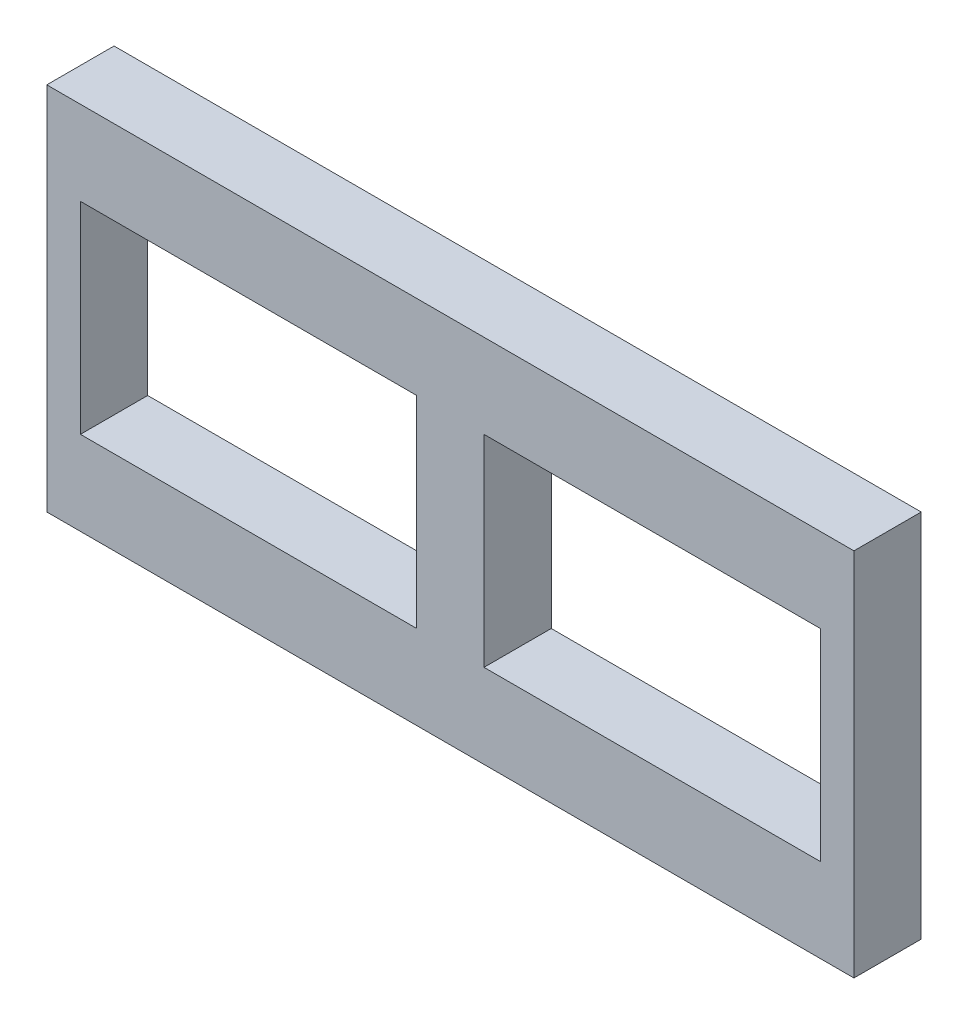
ISO-10303-21;
HEADER;
FILE_DESCRIPTION(('STEP AP214'),'2;1');
FILE_NAME('part.step','',(''),(''),'','','');
FILE_SCHEMA(('AUTOMOTIVE_DESIGN { 1 0 10303 214 1 1 1 1 }'));
ENDSEC;
DATA;
#1=APPLICATION_CONTEXT('core data for automotive mechanical design processes');
#2=APPLICATION_PROTOCOL_DEFINITION('international standard','automotive_design',2000,#1);
#3=PRODUCT_CONTEXT('',#1,'mechanical');
#4=PRODUCT('Part','Part','',(#3));
#5=PRODUCT_RELATED_PRODUCT_CATEGORY('part','',(#4));
#6=PRODUCT_DEFINITION_FORMATION('','',#4);
#7=PRODUCT_DEFINITION_CONTEXT('part definition',#1,'design');
#8=PRODUCT_DEFINITION('design','',#6,#7);
#9=PRODUCT_DEFINITION_SHAPE('','',#8);
#10=(LENGTH_UNIT() NAMED_UNIT(*) SI_UNIT(.MILLI.,.METRE.));
#11=(NAMED_UNIT(*) PLANE_ANGLE_UNIT() SI_UNIT($,.RADIAN.));
#12=(NAMED_UNIT(*) SI_UNIT($,.STERADIAN.) SOLID_ANGLE_UNIT());
#13=UNCERTAINTY_MEASURE_WITH_UNIT(LENGTH_MEASURE(1.E-05),#10,'distance_accuracy_value','');
#14=(GEOMETRIC_REPRESENTATION_CONTEXT(3) GLOBAL_UNCERTAINTY_ASSIGNED_CONTEXT((#13)) GLOBAL_UNIT_ASSIGNED_CONTEXT((#10,
#11,#12)) REPRESENTATION_CONTEXT('',''));
#15=CARTESIAN_POINT('',(0.,0.,0.));
#16=DIRECTION('',(0.,0.,1.));
#17=DIRECTION('',(1.,0.,0.));
#18=AXIS2_PLACEMENT_3D('',#15,#16,#17);
#19=CARTESIAN_POINT('',(-60.,27.5,10.));
#20=DIRECTION('',(1.,0.,0.));
#21=DIRECTION('',(0.,1.,0.));
#22=AXIS2_PLACEMENT_3D('',#19,#20,#21);
#23=PLANE('',#22);
#24=DIRECTION('',(0.,-1.,0.));
#25=VECTOR('',#24,1.);
#26=CARTESIAN_POINT('',(-60.,27.5,0.));
#27=LINE('',#26,#25);
#28=CARTESIAN_POINT('',(-60.,27.5,0.));
#29=VERTEX_POINT('',#28);
#30=CARTESIAN_POINT('',(-60.,-27.5,0.));
#31=VERTEX_POINT('',#30);
#32=EDGE_CURVE('E176',#29,#31,#27,.T.);
#33=ORIENTED_EDGE('',*,*,#32,.T.);
#34=DIRECTION('',(0.,0.,-1.));
#35=VECTOR('',#34,1.);
#36=CARTESIAN_POINT('',(-60.,-27.5,10.));
#37=LINE('',#36,#35);
#38=CARTESIAN_POINT('',(-60.,-27.5,10.));
#39=VERTEX_POINT('',#38);
#40=EDGE_CURVE('E11',#39,#31,#37,.T.);
#41=ORIENTED_EDGE('',*,*,#40,.F.);
#42=DIRECTION('',(0.,-1.,0.));
#43=VECTOR('',#42,1.);
#44=CARTESIAN_POINT('',(-60.,27.5,10.));
#45=LINE('',#44,#43);
#46=CARTESIAN_POINT('',(-60.,27.5,10.));
#47=VERTEX_POINT('',#46);
#48=EDGE_CURVE('E223',#47,#39,#45,.T.);
#49=ORIENTED_EDGE('',*,*,#48,.F.);
#50=DIRECTION('',(0.,0.,-1.));
#51=VECTOR('',#50,1.);
#52=CARTESIAN_POINT('',(-60.,27.5,10.));
#53=LINE('',#52,#51);
#54=EDGE_CURVE('E237',#47,#29,#53,.T.);
#55=ORIENTED_EDGE('',*,*,#54,.T.);
#56=EDGE_LOOP('',(#33,#41,#49,#55));
#57=FACE_BOUND('',#56,.T.);
#58=ADVANCED_FACE('F39',(#57),#23,.F.);
#59=CARTESIAN_POINT('',(-60.,-27.5,10.));
#60=DIRECTION('',(0.,1.,0.));
#61=DIRECTION('',(0.,0.,1.));
#62=AXIS2_PLACEMENT_3D('',#59,#60,#61);
#63=PLANE('',#62);
#64=DIRECTION('',(1.,0.,0.));
#65=VECTOR('',#64,1.);
#66=CARTESIAN_POINT('',(-60.,-27.5,0.));
#67=LINE('',#66,#65);
#68=CARTESIAN_POINT('',(60.,-27.5,0.));
#69=VERTEX_POINT('',#68);
#70=EDGE_CURVE('E241',#31,#69,#67,.T.);
#71=ORIENTED_EDGE('',*,*,#70,.T.);
#72=DIRECTION('',(0.,0.,-1.));
#73=VECTOR('',#72,1.);
#74=CARTESIAN_POINT('',(60.,-27.5,10.));
#75=LINE('',#74,#73);
#76=CARTESIAN_POINT('',(60.,-27.5,10.));
#77=VERTEX_POINT('',#76);
#78=EDGE_CURVE('E47',#77,#69,#75,.T.);
#79=ORIENTED_EDGE('',*,*,#78,.F.);
#80=DIRECTION('',(1.,0.,0.));
#81=VECTOR('',#80,1.);
#82=CARTESIAN_POINT('',(-60.,-27.5,10.));
#83=LINE('',#82,#81);
#84=EDGE_CURVE('E227',#39,#77,#83,.T.);
#85=ORIENTED_EDGE('',*,*,#84,.F.);
#86=ORIENTED_EDGE('',*,*,#40,.T.);
#87=EDGE_LOOP('',(#71,#79,#85,#86));
#88=FACE_BOUND('',#87,.T.);
#89=ADVANCED_FACE('F276',(#88),#63,.F.);
#90=CARTESIAN_POINT('',(60.,27.5,10.));
#91=DIRECTION('',(-1.,0.,0.));
#92=DIRECTION('',(0.,-1.,0.));
#93=AXIS2_PLACEMENT_3D('',#90,#91,#92);
#94=PLANE('',#93);
#95=DIRECTION('',(0.,1.,0.));
#96=VECTOR('',#95,1.);
#97=CARTESIAN_POINT('',(60.,27.5,0.));
#98=LINE('',#97,#96);
#99=CARTESIAN_POINT('',(60.,27.5,0.));
#100=VERTEX_POINT('',#99);
#101=EDGE_CURVE('E244',#69,#100,#98,.T.);
#102=ORIENTED_EDGE('',*,*,#101,.T.);
#103=DIRECTION('',(0.,0.,-1.));
#104=VECTOR('',#103,1.);
#105=CARTESIAN_POINT('',(60.,27.5,10.));
#106=LINE('',#105,#104);
#107=CARTESIAN_POINT('',(60.,27.5,10.));
#108=VERTEX_POINT('',#107);
#109=EDGE_CURVE('E252',#108,#100,#106,.T.);
#110=ORIENTED_EDGE('',*,*,#109,.F.);
#111=DIRECTION('',(0.,1.,0.));
#112=VECTOR('',#111,1.);
#113=CARTESIAN_POINT('',(60.,27.5,10.));
#114=LINE('',#113,#112);
#115=EDGE_CURVE('E231',#77,#108,#114,.T.);
#116=ORIENTED_EDGE('',*,*,#115,.F.);
#117=ORIENTED_EDGE('',*,*,#78,.T.);
#118=EDGE_LOOP('',(#102,#110,#116,#117));
#119=FACE_BOUND('',#118,.T.);
#120=ADVANCED_FACE('F261',(#119),#94,.F.);
#121=CARTESIAN_POINT('',(-60.,27.5,10.));
#122=DIRECTION('',(0.,-1.,0.));
#123=DIRECTION('',(0.,0.,-1.));
#124=AXIS2_PLACEMENT_3D('',#121,#122,#123);
#125=PLANE('',#124);
#126=DIRECTION('',(-1.,0.,0.));
#127=VECTOR('',#126,1.);
#128=CARTESIAN_POINT('',(-60.,27.5,0.));
#129=LINE('',#128,#127);
#130=EDGE_CURVE('E228',#100,#29,#129,.T.);
#131=ORIENTED_EDGE('',*,*,#130,.T.);
#132=ORIENTED_EDGE('',*,*,#54,.F.);
#133=DIRECTION('',(-1.,0.,0.));
#134=VECTOR('',#133,1.);
#135=CARTESIAN_POINT('',(-60.,27.5,10.));
#136=LINE('',#135,#134);
#137=EDGE_CURVE('E234',#108,#47,#136,.T.);
#138=ORIENTED_EDGE('',*,*,#137,.F.);
#139=ORIENTED_EDGE('',*,*,#109,.T.);
#140=EDGE_LOOP('',(#131,#132,#138,#139));
#141=FACE_BOUND('',#140,.T.);
#142=ADVANCED_FACE('F270',(#141),#125,.F.);
#143=CARTESIAN_POINT('',(0.,0.,10.));
#144=DIRECTION('',(0.,0.,1.));
#145=DIRECTION('',(1.,0.,0.));
#146=AXIS2_PLACEMENT_3D('',#143,#144,#145);
#147=PLANE('',#146);
#148=DIRECTION('',(0.,-1.,0.));
#149=VECTOR('',#148,1.);
#150=CARTESIAN_POINT('',(55.,15.,10.));
#151=LINE('',#150,#149);
#152=CARTESIAN_POINT('',(55.,15.,10.));
#153=VERTEX_POINT('',#152);
#154=CARTESIAN_POINT('',(55.,-15.,10.));
#155=VERTEX_POINT('',#154);
#156=EDGE_CURVE('E132',#153,#155,#151,.T.);
#157=ORIENTED_EDGE('',*,*,#156,.T.);
#158=DIRECTION('',(-1.,0.,0.));
#159=VECTOR('',#158,1.);
#160=CARTESIAN_POINT('',(55.,-15.,10.));
#161=LINE('',#160,#159);
#162=CARTESIAN_POINT('',(5.,-15.,10.));
#163=VERTEX_POINT('',#162);
#164=EDGE_CURVE('E144',#155,#163,#161,.T.);
#165=ORIENTED_EDGE('',*,*,#164,.T.);
#166=DIRECTION('',(0.,1.,0.));
#167=VECTOR('',#166,1.);
#168=CARTESIAN_POINT('',(5.,15.,10.));
#169=LINE('',#168,#167);
#170=CARTESIAN_POINT('',(5.,15.,10.));
#171=VERTEX_POINT('',#170);
#172=EDGE_CURVE('E54',#163,#171,#169,.T.);
#173=ORIENTED_EDGE('',*,*,#172,.T.);
#174=DIRECTION('',(1.,0.,0.));
#175=VECTOR('',#174,1.);
#176=CARTESIAN_POINT('',(55.,15.,10.));
#177=LINE('',#176,#175);
#178=EDGE_CURVE('E141',#171,#153,#177,.T.);
#179=ORIENTED_EDGE('',*,*,#178,.T.);
#180=EDGE_LOOP('',(#157,#165,#173,#179));
#181=FACE_BOUND('',#180,.T.);
#182=DIRECTION('',(1.,0.,0.));
#183=VECTOR('',#182,1.);
#184=CARTESIAN_POINT('',(-55.,15.,10.));
#185=LINE('',#184,#183);
#186=CARTESIAN_POINT('',(-55.,15.,10.));
#187=VERTEX_POINT('',#186);
#188=CARTESIAN_POINT('',(-5.,15.,10.));
#189=VERTEX_POINT('',#188);
#190=EDGE_CURVE('E182',#187,#189,#185,.T.);
#191=ORIENTED_EDGE('',*,*,#190,.T.);
#192=DIRECTION('',(0.,-1.,0.));
#193=VECTOR('',#192,1.);
#194=CARTESIAN_POINT('',(-5.,15.,10.));
#195=LINE('',#194,#193);
#196=CARTESIAN_POINT('',(-5.,-15.,10.));
#197=VERTEX_POINT('',#196);
#198=EDGE_CURVE('E186',#189,#197,#195,.T.);
#199=ORIENTED_EDGE('',*,*,#198,.T.);
#200=DIRECTION('',(-1.,0.,0.));
#201=VECTOR('',#200,1.);
#202=CARTESIAN_POINT('',(-55.,-15.,10.));
#203=LINE('',#202,#201);
#204=CARTESIAN_POINT('',(-55.,-15.,10.));
#205=VERTEX_POINT('',#204);
#206=EDGE_CURVE('E62',#197,#205,#203,.T.);
#207=ORIENTED_EDGE('',*,*,#206,.T.);
#208=DIRECTION('',(0.,1.,0.));
#209=VECTOR('',#208,1.);
#210=CARTESIAN_POINT('',(-55.,15.,10.));
#211=LINE('',#210,#209);
#212=EDGE_CURVE('E193',#205,#187,#211,.T.);
#213=ORIENTED_EDGE('',*,*,#212,.T.);
#214=EDGE_LOOP('',(#191,#199,#207,#213));
#215=FACE_BOUND('',#214,.T.);
#216=ORIENTED_EDGE('',*,*,#48,.T.);
#217=ORIENTED_EDGE('',*,*,#84,.T.);
#218=ORIENTED_EDGE('',*,*,#115,.T.);
#219=ORIENTED_EDGE('',*,*,#137,.T.);
#220=EDGE_LOOP('',(#216,#217,#218,#219));
#221=FACE_BOUND('',#220,.T.);
#222=ADVANCED_FACE('F149',(#181,#215,#221),#147,.T.);
#223=CARTESIAN_POINT('',(0.,0.,0.));
#224=DIRECTION('',(0.,0.,1.));
#225=DIRECTION('',(1.,0.,0.));
#226=AXIS2_PLACEMENT_3D('',#223,#224,#225);
#227=PLANE('',#226);
#228=DIRECTION('',(-1.,0.,0.));
#229=VECTOR('',#228,1.);
#230=CARTESIAN_POINT('',(55.,-15.,0.));
#231=LINE('',#230,#229);
#232=CARTESIAN_POINT('',(55.,-15.,0.));
#233=VERTEX_POINT('',#232);
#234=CARTESIAN_POINT('',(5.,-15.,0.));
#235=VERTEX_POINT('',#234);
#236=EDGE_CURVE('E166',#233,#235,#231,.T.);
#237=ORIENTED_EDGE('',*,*,#236,.F.);
#238=DIRECTION('',(0.,-1.,0.));
#239=VECTOR('',#238,1.);
#240=CARTESIAN_POINT('',(55.,15.,0.));
#241=LINE('',#240,#239);
#242=CARTESIAN_POINT('',(55.,15.,0.));
#243=VERTEX_POINT('',#242);
#244=EDGE_CURVE('E135',#243,#233,#241,.T.);
#245=ORIENTED_EDGE('',*,*,#244,.F.);
#246=DIRECTION('',(1.,0.,0.));
#247=VECTOR('',#246,1.);
#248=CARTESIAN_POINT('',(55.,15.,0.));
#249=LINE('',#248,#247);
#250=CARTESIAN_POINT('',(5.,15.,0.));
#251=VERTEX_POINT('',#250);
#252=EDGE_CURVE('E153',#251,#243,#249,.T.);
#253=ORIENTED_EDGE('',*,*,#252,.F.);
#254=DIRECTION('',(0.,1.,0.));
#255=VECTOR('',#254,1.);
#256=CARTESIAN_POINT('',(5.,15.,0.));
#257=LINE('',#256,#255);
#258=EDGE_CURVE('E157',#235,#251,#257,.T.);
#259=ORIENTED_EDGE('',*,*,#258,.F.);
#260=EDGE_LOOP('',(#237,#245,#253,#259));
#261=FACE_BOUND('',#260,.T.);
#262=DIRECTION('',(0.,-1.,0.));
#263=VECTOR('',#262,1.);
#264=CARTESIAN_POINT('',(-5.,15.,0.));
#265=LINE('',#264,#263);
#266=CARTESIAN_POINT('',(-5.,15.,0.));
#267=VERTEX_POINT('',#266);
#268=CARTESIAN_POINT('',(-5.,-15.,0.));
#269=VERTEX_POINT('',#268);
#270=EDGE_CURVE('E201',#267,#269,#265,.T.);
#271=ORIENTED_EDGE('',*,*,#270,.F.);
#272=DIRECTION('',(1.,0.,0.));
#273=VECTOR('',#272,1.);
#274=CARTESIAN_POINT('',(-55.,15.,0.));
#275=LINE('',#274,#273);
#276=CARTESIAN_POINT('',(-55.,15.,0.));
#277=VERTEX_POINT('',#276);
#278=EDGE_CURVE('E198',#277,#267,#275,.T.);
#279=ORIENTED_EDGE('',*,*,#278,.F.);
#280=DIRECTION('',(0.,1.,0.));
#281=VECTOR('',#280,1.);
#282=CARTESIAN_POINT('',(-55.,15.,0.));
#283=LINE('',#282,#281);
#284=CARTESIAN_POINT('',(-55.,-15.,0.));
#285=VERTEX_POINT('',#284);
#286=EDGE_CURVE('E187',#285,#277,#283,.T.);
#287=ORIENTED_EDGE('',*,*,#286,.F.);
#288=DIRECTION('',(-1.,0.,0.));
#289=VECTOR('',#288,1.);
#290=CARTESIAN_POINT('',(-55.,-15.,0.));
#291=LINE('',#290,#289);
#292=EDGE_CURVE('E205',#269,#285,#291,.T.);
#293=ORIENTED_EDGE('',*,*,#292,.F.);
#294=EDGE_LOOP('',(#271,#279,#287,#293));
#295=FACE_BOUND('',#294,.T.);
#296=ORIENTED_EDGE('',*,*,#32,.F.);
#297=ORIENTED_EDGE('',*,*,#130,.F.);
#298=ORIENTED_EDGE('',*,*,#101,.F.);
#299=ORIENTED_EDGE('',*,*,#70,.F.);
#300=EDGE_LOOP('',(#296,#297,#298,#299));
#301=FACE_BOUND('',#300,.T.);
#302=ADVANCED_FACE('F267',(#261,#295,#301),#227,.F.);
#303=CARTESIAN_POINT('',(-55.,15.,10.));
#304=DIRECTION('',(0.,1.,0.));
#305=DIRECTION('',(0.,0.,1.));
#306=AXIS2_PLACEMENT_3D('',#303,#304,#305);
#307=PLANE('',#306);
#308=ORIENTED_EDGE('',*,*,#278,.T.);
#309=DIRECTION('',(0.,0.,-1.));
#310=VECTOR('',#309,1.);
#311=CARTESIAN_POINT('',(-5.,15.,10.));
#312=LINE('',#311,#310);
#313=EDGE_CURVE('E197',#189,#267,#312,.T.);
#314=ORIENTED_EDGE('',*,*,#313,.F.);
#315=ORIENTED_EDGE('',*,*,#190,.F.);
#316=DIRECTION('',(0.,0.,-1.));
#317=VECTOR('',#316,1.);
#318=CARTESIAN_POINT('',(-55.,15.,10.));
#319=LINE('',#318,#317);
#320=EDGE_CURVE('E167',#187,#277,#319,.T.);
#321=ORIENTED_EDGE('',*,*,#320,.T.);
#322=EDGE_LOOP('',(#308,#314,#315,#321));
#323=FACE_BOUND('',#322,.T.);
#324=ADVANCED_FACE('F288',(#323),#307,.F.);
#325=CARTESIAN_POINT('',(-55.,15.,10.));
#326=DIRECTION('',(-1.,0.,0.));
#327=DIRECTION('',(0.,-1.,0.));
#328=AXIS2_PLACEMENT_3D('',#325,#326,#327);
#329=PLANE('',#328);
#330=ORIENTED_EDGE('',*,*,#286,.T.);
#331=ORIENTED_EDGE('',*,*,#320,.F.);
#332=ORIENTED_EDGE('',*,*,#212,.F.);
#333=DIRECTION('',(0.,0.,-1.));
#334=VECTOR('',#333,1.);
#335=CARTESIAN_POINT('',(-55.,-15.,10.));
#336=LINE('',#335,#334);
#337=EDGE_CURVE('E214',#205,#285,#336,.T.);
#338=ORIENTED_EDGE('',*,*,#337,.T.);
#339=EDGE_LOOP('',(#330,#331,#332,#338));
#340=FACE_BOUND('',#339,.T.);
#341=ADVANCED_FACE('F294',(#340),#329,.F.);
#342=CARTESIAN_POINT('',(-55.,-15.,10.));
#343=DIRECTION('',(0.,-1.,0.));
#344=DIRECTION('',(0.,0.,-1.));
#345=AXIS2_PLACEMENT_3D('',#342,#343,#344);
#346=PLANE('',#345);
#347=ORIENTED_EDGE('',*,*,#292,.T.);
#348=ORIENTED_EDGE('',*,*,#337,.F.);
#349=ORIENTED_EDGE('',*,*,#206,.F.);
#350=DIRECTION('',(0.,0.,-1.));
#351=VECTOR('',#350,1.);
#352=CARTESIAN_POINT('',(-5.,-15.,10.));
#353=LINE('',#352,#351);
#354=EDGE_CURVE('E217',#197,#269,#353,.T.);
#355=ORIENTED_EDGE('',*,*,#354,.T.);
#356=EDGE_LOOP('',(#347,#348,#349,#355));
#357=FACE_BOUND('',#356,.T.);
#358=ADVANCED_FACE('F299',(#357),#346,.F.);
#359=CARTESIAN_POINT('',(-5.,15.,10.));
#360=DIRECTION('',(1.,0.,0.));
#361=DIRECTION('',(0.,1.,0.));
#362=AXIS2_PLACEMENT_3D('',#359,#360,#361);
#363=PLANE('',#362);
#364=ORIENTED_EDGE('',*,*,#270,.T.);
#365=ORIENTED_EDGE('',*,*,#354,.F.);
#366=ORIENTED_EDGE('',*,*,#198,.F.);
#367=ORIENTED_EDGE('',*,*,#313,.T.);
#368=EDGE_LOOP('',(#364,#365,#366,#367));
#369=FACE_BOUND('',#368,.T.);
#370=ADVANCED_FACE('F296',(#369),#363,.F.);
#371=CARTESIAN_POINT('',(55.,15.,10.));
#372=DIRECTION('',(1.,0.,0.));
#373=DIRECTION('',(0.,1.,0.));
#374=AXIS2_PLACEMENT_3D('',#371,#372,#373);
#375=PLANE('',#374);
#376=ORIENTED_EDGE('',*,*,#244,.T.);
#377=DIRECTION('',(0.,0.,-1.));
#378=VECTOR('',#377,1.);
#379=CARTESIAN_POINT('',(55.,-15.,10.));
#380=LINE('',#379,#378);
#381=EDGE_CURVE('E128',#155,#233,#380,.T.);
#382=ORIENTED_EDGE('',*,*,#381,.F.);
#383=ORIENTED_EDGE('',*,*,#156,.F.);
#384=DIRECTION('',(0.,0.,-1.));
#385=VECTOR('',#384,1.);
#386=CARTESIAN_POINT('',(55.,15.,10.));
#387=LINE('',#386,#385);
#388=EDGE_CURVE('E173',#153,#243,#387,.T.);
#389=ORIENTED_EDGE('',*,*,#388,.T.);
#390=EDGE_LOOP('',(#376,#382,#383,#389));
#391=FACE_BOUND('',#390,.T.);
#392=ADVANCED_FACE('F130',(#391),#375,.F.);
#393=CARTESIAN_POINT('',(55.,15.,10.));
#394=DIRECTION('',(0.,1.,0.));
#395=DIRECTION('',(0.,0.,1.));
#396=AXIS2_PLACEMENT_3D('',#393,#394,#395);
#397=PLANE('',#396);
#398=ORIENTED_EDGE('',*,*,#252,.T.);
#399=ORIENTED_EDGE('',*,*,#388,.F.);
#400=ORIENTED_EDGE('',*,*,#178,.F.);
#401=DIRECTION('',(0.,0.,-1.));
#402=VECTOR('',#401,1.);
#403=CARTESIAN_POINT('',(5.,15.,10.));
#404=LINE('',#403,#402);
#405=EDGE_CURVE('E177',#171,#251,#404,.T.);
#406=ORIENTED_EDGE('',*,*,#405,.T.);
#407=EDGE_LOOP('',(#398,#399,#400,#406));
#408=FACE_BOUND('',#407,.T.);
#409=ADVANCED_FACE('F308',(#408),#397,.F.);
#410=CARTESIAN_POINT('',(5.,15.,10.));
#411=DIRECTION('',(-1.,0.,0.));
#412=DIRECTION('',(0.,-1.,0.));
#413=AXIS2_PLACEMENT_3D('',#410,#411,#412);
#414=PLANE('',#413);
#415=ORIENTED_EDGE('',*,*,#258,.T.);
#416=ORIENTED_EDGE('',*,*,#405,.F.);
#417=ORIENTED_EDGE('',*,*,#172,.F.);
#418=DIRECTION('',(0.,0.,-1.));
#419=VECTOR('',#418,1.);
#420=CARTESIAN_POINT('',(5.,-15.,10.));
#421=LINE('',#420,#419);
#422=EDGE_CURVE('E140',#163,#235,#421,.T.);
#423=ORIENTED_EDGE('',*,*,#422,.T.);
#424=EDGE_LOOP('',(#415,#416,#417,#423));
#425=FACE_BOUND('',#424,.T.);
#426=ADVANCED_FACE('F311',(#425),#414,.F.);
#427=CARTESIAN_POINT('',(55.,-15.,10.));
#428=DIRECTION('',(0.,-1.,0.));
#429=DIRECTION('',(0.,0.,-1.));
#430=AXIS2_PLACEMENT_3D('',#427,#428,#429);
#431=PLANE('',#430);
#432=ORIENTED_EDGE('',*,*,#236,.T.);
#433=ORIENTED_EDGE('',*,*,#422,.F.);
#434=ORIENTED_EDGE('',*,*,#164,.F.);
#435=ORIENTED_EDGE('',*,*,#381,.T.);
#436=EDGE_LOOP('',(#432,#433,#434,#435));
#437=FACE_BOUND('',#436,.T.);
#438=ADVANCED_FACE('F145',(#437),#431,.F.);
#439=CLOSED_SHELL('',(#58,#89,#120,#142,#222,#302,#324,#341,#358,#370,#392,#409,#426,#438));
#440=MANIFOLD_SOLID_BREP('B2',#439);
#441=ADVANCED_BREP_SHAPE_REPRESENTATION('',(#18,#440),#14);
#442=SHAPE_DEFINITION_REPRESENTATION(#9,#441);
ENDSEC;
END-ISO-10303-21;
